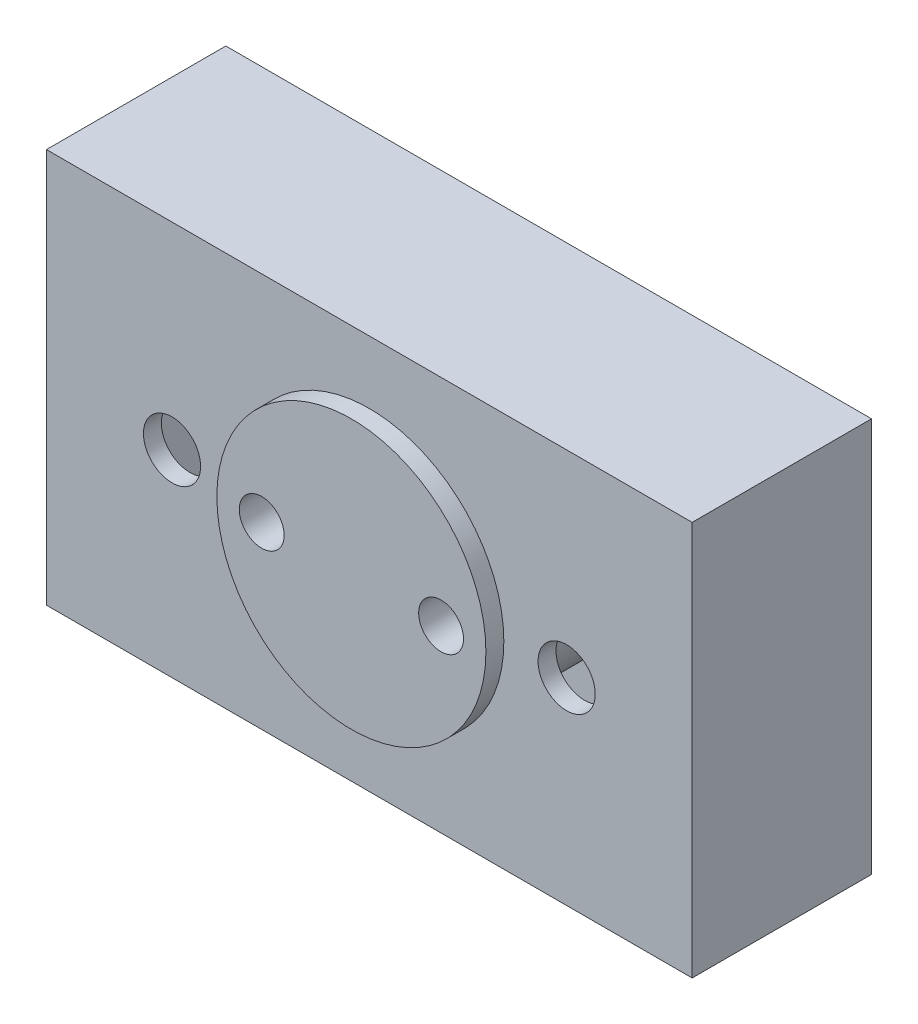
ISO-10303-21;
HEADER;
FILE_DESCRIPTION(('STEP AP214'),'2;1');
FILE_NAME('part.step','',(''),(''),'','','');
FILE_SCHEMA(('AUTOMOTIVE_DESIGN { 1 0 10303 214 1 1 1 1 }'));
ENDSEC;
DATA;
#1=APPLICATION_CONTEXT('core data for automotive mechanical design processes');
#2=APPLICATION_PROTOCOL_DEFINITION('international standard','automotive_design',2000,#1);
#3=PRODUCT_CONTEXT('',#1,'mechanical');
#4=PRODUCT('Part','Part','',(#3));
#5=PRODUCT_RELATED_PRODUCT_CATEGORY('part','',(#4));
#6=PRODUCT_DEFINITION_FORMATION('','',#4);
#7=PRODUCT_DEFINITION_CONTEXT('part definition',#1,'design');
#8=PRODUCT_DEFINITION('design','',#6,#7);
#9=PRODUCT_DEFINITION_SHAPE('','',#8);
#10=(LENGTH_UNIT() NAMED_UNIT(*) SI_UNIT(.MILLI.,.METRE.));
#11=(NAMED_UNIT(*) PLANE_ANGLE_UNIT() SI_UNIT($,.RADIAN.));
#12=(NAMED_UNIT(*) SI_UNIT($,.STERADIAN.) SOLID_ANGLE_UNIT());
#13=UNCERTAINTY_MEASURE_WITH_UNIT(LENGTH_MEASURE(1.E-05),#10,'distance_accuracy_value','');
#14=(GEOMETRIC_REPRESENTATION_CONTEXT(3) GLOBAL_UNCERTAINTY_ASSIGNED_CONTEXT((#13)) GLOBAL_UNIT_ASSIGNED_CONTEXT((#10,
#11,#12)) REPRESENTATION_CONTEXT('',''));
#15=CARTESIAN_POINT('',(0.,0.,0.));
#16=DIRECTION('',(0.,0.,1.));
#17=DIRECTION('',(1.,0.,0.));
#18=AXIS2_PLACEMENT_3D('',#15,#16,#17);
#19=CARTESIAN_POINT('',(-114.3,-69.85,57.15));
#20=DIRECTION('',(0.,0.,1.));
#21=DIRECTION('',(1.,0.,0.));
#22=AXIS2_PLACEMENT_3D('',#19,#20,#21);
#23=PLANE('',#22);
#24=CARTESIAN_POINT('',(69.85,0.,57.15));
#25=DIRECTION('',(0.,0.,1.));
#26=DIRECTION('',(1.,0.,0.));
#27=AXIS2_PLACEMENT_3D('',#24,#25,#26);
#28=CIRCLE('',#27,10.1203125);
#29=CARTESIAN_POINT('',(79.9703125,0.,57.15));
#30=VERTEX_POINT('',#29);
#31=EDGE_CURVE('E445',#30,#30,#28,.T.);
#32=ORIENTED_EDGE('',*,*,#31,.F.);
#33=EDGE_LOOP('',(#32));
#34=FACE_BOUND('',#33,.T.);
#35=DIRECTION('',(0.,-1.,0.));
#36=VECTOR('',#35,1.);
#37=CARTESIAN_POINT('',(-114.3,69.85,57.15));
#38=LINE('',#37,#36);
#39=CARTESIAN_POINT('',(-114.3,69.85,57.15));
#40=VERTEX_POINT('',#39);
#41=CARTESIAN_POINT('',(-114.3,-69.85,57.15));
#42=VERTEX_POINT('',#41);
#43=EDGE_CURVE('E421',#40,#42,#38,.T.);
#44=ORIENTED_EDGE('',*,*,#43,.T.);
#45=DIRECTION('',(1.,0.,0.));
#46=VECTOR('',#45,1.);
#47=CARTESIAN_POINT('',(-114.3,-69.85,57.15));
#48=LINE('',#47,#46);
#49=CARTESIAN_POINT('',(114.3,-69.85,57.15));
#50=VERTEX_POINT('',#49);
#51=EDGE_CURVE('E430',#42,#50,#48,.T.);
#52=ORIENTED_EDGE('',*,*,#51,.T.);
#53=DIRECTION('',(0.,1.,0.));
#54=VECTOR('',#53,1.);
#55=CARTESIAN_POINT('',(114.3,69.85,57.15));
#56=LINE('',#55,#54);
#57=CARTESIAN_POINT('',(114.3,69.85,57.15));
#58=VERTEX_POINT('',#57);
#59=EDGE_CURVE('E436',#50,#58,#56,.T.);
#60=ORIENTED_EDGE('',*,*,#59,.T.);
#61=DIRECTION('',(-1.,0.,0.));
#62=VECTOR('',#61,1.);
#63=CARTESIAN_POINT('',(-114.3,69.85,57.15));
#64=LINE('',#63,#62);
#65=EDGE_CURVE('E441',#58,#40,#64,.T.);
#66=ORIENTED_EDGE('',*,*,#65,.T.);
#67=EDGE_LOOP('',(#44,#52,#60,#66));
#68=FACE_BOUND('',#67,.T.);
#69=CARTESIAN_POINT('',(0.,0.,57.15));
#70=DIRECTION('',(0.,0.,1.));
#71=DIRECTION('',(1.,0.,0.));
#72=AXIS2_PLACEMENT_3D('',#69,#70,#71);
#73=CIRCLE('',#72,47.625);
#74=CARTESIAN_POINT('',(47.625,0.,57.15));
#75=VERTEX_POINT('',#74);
#76=EDGE_CURVE('E450',#75,#75,#73,.T.);
#77=ORIENTED_EDGE('',*,*,#76,.F.);
#78=EDGE_LOOP('',(#77));
#79=FACE_BOUND('',#78,.T.);
#80=CARTESIAN_POINT('',(-69.85,0.,57.15));
#81=DIRECTION('',(0.,0.,1.));
#82=DIRECTION('',(1.,0.,0.));
#83=AXIS2_PLACEMENT_3D('',#80,#81,#82);
#84=CIRCLE('',#83,10.1203125);
#85=CARTESIAN_POINT('',(-59.7296875,0.,57.15));
#86=VERTEX_POINT('',#85);
#87=EDGE_CURVE('E594',#86,#86,#84,.T.);
#88=ORIENTED_EDGE('',*,*,#87,.F.);
#89=EDGE_LOOP('',(#88));
#90=FACE_BOUND('',#89,.T.);
#91=ADVANCED_FACE('F352',(#34,#68,#79,#90),#23,.T.);
#92=CARTESIAN_POINT('',(-114.3,-69.85,50.8));
#93=DIRECTION('',(0.,0.,1.));
#94=DIRECTION('',(1.,0.,0.));
#95=AXIS2_PLACEMENT_3D('',#92,#93,#94);
#96=PLANE('',#95);
#97=CARTESIAN_POINT('',(69.85,0.,50.8));
#98=DIRECTION('',(0.,0.,1.));
#99=DIRECTION('',(1.,0.,0.));
#100=AXIS2_PLACEMENT_3D('',#97,#98,#99);
#101=CIRCLE('',#100,10.1203125);
#102=CARTESIAN_POINT('',(79.9703125,0.,50.8));
#103=VERTEX_POINT('',#102);
#104=EDGE_CURVE('E442',#103,#103,#101,.F.);
#105=ORIENTED_EDGE('',*,*,#104,.F.);
#106=EDGE_LOOP('',(#105));
#107=FACE_BOUND('',#106,.T.);
#108=DIRECTION('',(0.,-1.,0.));
#109=VECTOR('',#108,1.);
#110=CARTESIAN_POINT('',(-107.95,-208.524002802,50.8));
#111=LINE('',#110,#109);
#112=CARTESIAN_POINT('',(-107.95,63.5,50.8));
#113=VERTEX_POINT('',#112);
#114=CARTESIAN_POINT('',(-107.95,-63.5,50.8));
#115=VERTEX_POINT('',#114);
#116=EDGE_CURVE('E479',#113,#115,#111,.T.);
#117=ORIENTED_EDGE('',*,*,#116,.F.);
#118=DIRECTION('',(1.,0.,0.));
#119=VECTOR('',#118,1.);
#120=CARTESIAN_POINT('',(0.,63.5,50.8));
#121=LINE('',#120,#119);
#122=CARTESIAN_POINT('',(107.95,63.5,50.8));
#123=VERTEX_POINT('',#122);
#124=EDGE_CURVE('E482',#113,#123,#121,.T.);
#125=ORIENTED_EDGE('',*,*,#124,.T.);
#126=DIRECTION('',(0.,-1.,0.));
#127=VECTOR('',#126,1.);
#128=CARTESIAN_POINT('',(107.95,-208.524002802,50.8));
#129=LINE('',#128,#127);
#130=CARTESIAN_POINT('',(107.95,-63.5,50.8));
#131=VERTEX_POINT('',#130);
#132=EDGE_CURVE('E484',#123,#131,#129,.T.);
#133=ORIENTED_EDGE('',*,*,#132,.T.);
#134=DIRECTION('',(1.,0.,0.));
#135=VECTOR('',#134,1.);
#136=CARTESIAN_POINT('',(0.,-63.5,50.8));
#137=LINE('',#136,#135);
#138=EDGE_CURVE('E486',#115,#131,#137,.T.);
#139=ORIENTED_EDGE('',*,*,#138,.F.);
#140=EDGE_LOOP('',(#117,#125,#133,#139));
#141=FACE_BOUND('',#140,.T.);
#142=CARTESIAN_POINT('',(0.,0.,50.8));
#143=DIRECTION('',(0.,0.,1.));
#144=DIRECTION('',(1.,0.,0.));
#145=AXIS2_PLACEMENT_3D('',#142,#143,#144);
#146=CIRCLE('',#145,47.625);
#147=CARTESIAN_POINT('',(47.625,0.,50.8));
#148=VERTEX_POINT('',#147);
#149=EDGE_CURVE('E11',#148,#148,#146,.T.);
#150=ORIENTED_EDGE('',*,*,#149,.T.);
#151=EDGE_LOOP('',(#150));
#152=FACE_BOUND('',#151,.T.);
#153=CARTESIAN_POINT('',(-69.85,0.,50.8));
#154=DIRECTION('',(0.,0.,1.));
#155=DIRECTION('',(1.,0.,0.));
#156=AXIS2_PLACEMENT_3D('',#153,#154,#155);
#157=CIRCLE('',#156,10.1203125);
#158=CARTESIAN_POINT('',(-59.7296875,0.,50.8));
#159=VERTEX_POINT('',#158);
#160=EDGE_CURVE('E592',#159,#159,#157,.F.);
#161=ORIENTED_EDGE('',*,*,#160,.F.);
#162=EDGE_LOOP('',(#161));
#163=FACE_BOUND('',#162,.T.);
#164=ADVANCED_FACE('F539',(#107,#141,#152,#163),#96,.F.);
#165=CARTESIAN_POINT('',(114.3,69.85,0.));
#166=DIRECTION('',(0.,0.,-1.));
#167=DIRECTION('',(-1.,0.,0.));
#168=AXIS2_PLACEMENT_3D('',#165,#166,#167);
#169=PLANE('',#168);
#170=CARTESIAN_POINT('',(31.75,0.,0.));
#171=DIRECTION('',(0.,0.,1.));
#172=DIRECTION('',(1.,0.,0.));
#173=AXIS2_PLACEMENT_3D('',#170,#171,#172);
#174=CIRCLE('',#173,7.9375);
#175=CARTESIAN_POINT('',(39.6875,0.,0.));
#176=VERTEX_POINT('',#175);
#177=EDGE_CURVE('E457',#176,#176,#174,.T.);
#178=ORIENTED_EDGE('',*,*,#177,.T.);
#179=EDGE_LOOP('',(#178));
#180=FACE_BOUND('',#179,.T.);
#181=ADVANCED_FACE('F521',(#180),#169,.F.);
#182=CARTESIAN_POINT('',(-31.75,0.,0.));
#183=DIRECTION('',(0.,0.,1.));
#184=DIRECTION('',(1.,0.,0.));
#185=AXIS2_PLACEMENT_3D('',#182,#183,#184);
#186=CIRCLE('',#185,7.9375);
#187=CARTESIAN_POINT('',(-23.8125,0.,0.));
#188=VERTEX_POINT('',#187);
#189=EDGE_CURVE('E454',#188,#188,#186,.T.);
#190=ORIENTED_EDGE('',*,*,#189,.T.);
#191=EDGE_LOOP('',(#190));
#192=FACE_BOUND('',#191,.T.);
#193=ADVANCED_FACE('F520',(#192),#169,.F.);
#194=CARTESIAN_POINT('',(-114.3,69.85,-6.35));
#195=DIRECTION('',(0.,-1.,0.));
#196=DIRECTION('',(0.,0.,-1.));
#197=AXIS2_PLACEMENT_3D('',#194,#195,#196);
#198=PLANE('',#197);
#199=DIRECTION('',(0.,0.,1.));
#200=VECTOR('',#199,1.);
#201=CARTESIAN_POINT('',(-114.3,69.85,-6.35));
#202=LINE('',#201,#200);
#203=CARTESIAN_POINT('',(-114.3,69.85,-6.35));
#204=VERTEX_POINT('',#203);
#205=EDGE_CURVE('E376',#204,#40,#202,.T.);
#206=ORIENTED_EDGE('',*,*,#205,.T.);
#207=ORIENTED_EDGE('',*,*,#65,.F.);
#208=DIRECTION('',(0.,0.,1.));
#209=VECTOR('',#208,1.);
#210=CARTESIAN_POINT('',(114.3,69.85,-6.35));
#211=LINE('',#210,#209);
#212=CARTESIAN_POINT('',(114.3,69.85,-6.35));
#213=VERTEX_POINT('',#212);
#214=EDGE_CURVE('E506',#213,#58,#211,.T.);
#215=ORIENTED_EDGE('',*,*,#214,.F.);
#216=DIRECTION('',(1.,0.,0.));
#217=VECTOR('',#216,1.);
#218=CARTESIAN_POINT('',(-114.3,69.85,-6.35));
#219=LINE('',#218,#217);
#220=EDGE_CURVE('E497',#204,#213,#219,.T.);
#221=ORIENTED_EDGE('',*,*,#220,.F.);
#222=EDGE_LOOP('',(#206,#207,#215,#221));
#223=FACE_BOUND('',#222,.T.);
#224=ADVANCED_FACE('F354',(#223),#198,.F.);
#225=CARTESIAN_POINT('',(114.3,69.85,-6.35));
#226=DIRECTION('',(-1.,0.,0.));
#227=DIRECTION('',(0.,0.,1.));
#228=AXIS2_PLACEMENT_3D('',#225,#226,#227);
#229=PLANE('',#228);
#230=ORIENTED_EDGE('',*,*,#214,.T.);
#231=ORIENTED_EDGE('',*,*,#59,.F.);
#232=DIRECTION('',(0.,0.,1.));
#233=VECTOR('',#232,1.);
#234=CARTESIAN_POINT('',(114.3,-69.85,-6.35));
#235=LINE('',#234,#233);
#236=CARTESIAN_POINT('',(114.3,-69.85,-6.35));
#237=VERTEX_POINT('',#236);
#238=EDGE_CURVE('E427',#237,#50,#235,.T.);
#239=ORIENTED_EDGE('',*,*,#238,.F.);
#240=DIRECTION('',(0.,-1.,0.));
#241=VECTOR('',#240,1.);
#242=CARTESIAN_POINT('',(114.3,69.85,-6.35));
#243=LINE('',#242,#241);
#244=EDGE_CURVE('E500',#213,#237,#243,.T.);
#245=ORIENTED_EDGE('',*,*,#244,.F.);
#246=EDGE_LOOP('',(#230,#231,#239,#245));
#247=FACE_BOUND('',#246,.T.);
#248=ADVANCED_FACE('F645',(#247),#229,.F.);
#249=CARTESIAN_POINT('',(-114.3,-69.85,-6.35));
#250=DIRECTION('',(0.,-1.,0.));
#251=DIRECTION('',(1.,0.,0.));
#252=AXIS2_PLACEMENT_3D('',#249,#250,#251);
#253=PLANE('',#252);
#254=ORIENTED_EDGE('',*,*,#238,.T.);
#255=ORIENTED_EDGE('',*,*,#51,.F.);
#256=DIRECTION('',(0.,0.,1.));
#257=VECTOR('',#256,1.);
#258=CARTESIAN_POINT('',(-114.3,-69.85,-6.35));
#259=LINE('',#258,#257);
#260=CARTESIAN_POINT('',(-114.3,-69.85,-6.35));
#261=VERTEX_POINT('',#260);
#262=EDGE_CURVE('E417',#261,#42,#259,.T.);
#263=ORIENTED_EDGE('',*,*,#262,.F.);
#264=DIRECTION('',(1.,0.,0.));
#265=VECTOR('',#264,1.);
#266=CARTESIAN_POINT('',(-114.3,-69.85,-6.35));
#267=LINE('',#266,#265);
#268=EDGE_CURVE('E502',#261,#237,#267,.T.);
#269=ORIENTED_EDGE('',*,*,#268,.T.);
#270=EDGE_LOOP('',(#254,#255,#263,#269));
#271=FACE_BOUND('',#270,.T.);
#272=ADVANCED_FACE('F431',(#271),#253,.T.);
#273=CARTESIAN_POINT('',(-114.3,69.85,-6.35));
#274=DIRECTION('',(-1.,0.,0.));
#275=DIRECTION('',(0.,0.,1.));
#276=AXIS2_PLACEMENT_3D('',#273,#274,#275);
#277=PLANE('',#276);
#278=ORIENTED_EDGE('',*,*,#262,.T.);
#279=ORIENTED_EDGE('',*,*,#43,.F.);
#280=ORIENTED_EDGE('',*,*,#205,.F.);
#281=DIRECTION('',(0.,-1.,0.));
#282=VECTOR('',#281,1.);
#283=CARTESIAN_POINT('',(-114.3,69.85,-6.35));
#284=LINE('',#283,#282);
#285=EDGE_CURVE('E423',#204,#261,#284,.T.);
#286=ORIENTED_EDGE('',*,*,#285,.T.);
#287=EDGE_LOOP('',(#278,#279,#280,#286));
#288=FACE_BOUND('',#287,.T.);
#289=ADVANCED_FACE('F419',(#288),#277,.T.);
#290=CARTESIAN_POINT('',(114.3,69.85,-6.35));
#291=DIRECTION('',(0.,0.,-1.));
#292=DIRECTION('',(-1.,0.,0.));
#293=AXIS2_PLACEMENT_3D('',#290,#291,#292);
#294=PLANE('',#293);
#295=ORIENTED_EDGE('',*,*,#220,.T.);
#296=ORIENTED_EDGE('',*,*,#244,.T.);
#297=ORIENTED_EDGE('',*,*,#268,.F.);
#298=ORIENTED_EDGE('',*,*,#285,.F.);
#299=EDGE_LOOP('',(#295,#296,#297,#298));
#300=FACE_BOUND('',#299,.T.);
#301=ADVANCED_FACE('F563',(#300),#294,.T.);
#302=CARTESIAN_POINT('',(0.,0.,63.5));
#303=DIRECTION('',(0.,0.,-1.));
#304=DIRECTION('',(-1.,0.,0.));
#305=AXIS2_PLACEMENT_3D('',#302,#303,#304);
#306=CYLINDRICAL_SURFACE('',#305,47.625);
#307=ORIENTED_EDGE('',*,*,#76,.T.);
#308=EDGE_LOOP('',(#307));
#309=FACE_BOUND('',#308,.T.);
#310=CARTESIAN_POINT('',(0.,0.,63.5));
#311=DIRECTION('',(0.,0.,1.));
#312=DIRECTION('',(1.,0.,0.));
#313=AXIS2_PLACEMENT_3D('',#310,#311,#312);
#314=CIRCLE('',#313,47.625);
#315=CARTESIAN_POINT('',(47.625,0.,63.5));
#316=VERTEX_POINT('',#315);
#317=EDGE_CURVE('E463',#316,#316,#314,.T.);
#318=ORIENTED_EDGE('',*,*,#317,.F.);
#319=EDGE_LOOP('',(#318));
#320=FACE_BOUND('',#319,.T.);
#321=ADVANCED_FACE('F529',(#309,#320),#306,.T.);
#322=CARTESIAN_POINT('',(-31.75,0.,63.5));
#323=DIRECTION('',(0.,0.,-1.));
#324=DIRECTION('',(-1.,0.,0.));
#325=AXIS2_PLACEMENT_3D('',#322,#323,#324);
#326=CYLINDRICAL_SURFACE('',#325,7.9375);
#327=CARTESIAN_POINT('',(-31.75,0.,63.5));
#328=DIRECTION('',(0.,0.,1.));
#329=DIRECTION('',(1.,0.,0.));
#330=AXIS2_PLACEMENT_3D('',#327,#328,#329);
#331=CIRCLE('',#330,7.9375);
#332=CARTESIAN_POINT('',(-23.8125,0.,63.5));
#333=VERTEX_POINT('',#332);
#334=EDGE_CURVE('E460',#333,#333,#331,.T.);
#335=ORIENTED_EDGE('',*,*,#334,.T.);
#336=EDGE_LOOP('',(#335));
#337=FACE_BOUND('',#336,.T.);
#338=ORIENTED_EDGE('',*,*,#189,.F.);
#339=EDGE_LOOP('',(#338));
#340=FACE_BOUND('',#339,.T.);
#341=ADVANCED_FACE('F556',(#337,#340),#326,.F.);
#342=CARTESIAN_POINT('',(0.,-208.524002802,63.5));
#343=DIRECTION('',(0.,0.,1.));
#344=DIRECTION('',(1.,0.,0.));
#345=AXIS2_PLACEMENT_3D('',#342,#343,#344);
#346=PLANE('',#345);
#347=ORIENTED_EDGE('',*,*,#334,.F.);
#348=EDGE_LOOP('',(#347));
#349=FACE_BOUND('',#348,.T.);
#350=ORIENTED_EDGE('',*,*,#317,.T.);
#351=EDGE_LOOP('',(#350));
#352=FACE_BOUND('',#351,.T.);
#353=CARTESIAN_POINT('',(31.75,0.,63.5));
#354=DIRECTION('',(0.,0.,1.));
#355=DIRECTION('',(1.,0.,0.));
#356=AXIS2_PLACEMENT_3D('',#353,#354,#355);
#357=CIRCLE('',#356,7.9375);
#358=CARTESIAN_POINT('',(39.6875,0.,63.5));
#359=VERTEX_POINT('',#358);
#360=EDGE_CURVE('E466',#359,#359,#357,.T.);
#361=ORIENTED_EDGE('',*,*,#360,.F.);
#362=EDGE_LOOP('',(#361));
#363=FACE_BOUND('',#362,.T.);
#364=ADVANCED_FACE('F552',(#349,#352,#363),#346,.T.);
#365=CARTESIAN_POINT('',(31.75,0.,63.5));
#366=DIRECTION('',(0.,0.,-1.));
#367=DIRECTION('',(-1.,0.,0.));
#368=AXIS2_PLACEMENT_3D('',#365,#366,#367);
#369=CYLINDRICAL_SURFACE('',#368,7.9375);
#370=ORIENTED_EDGE('',*,*,#360,.T.);
#371=EDGE_LOOP('',(#370));
#372=FACE_BOUND('',#371,.T.);
#373=ORIENTED_EDGE('',*,*,#177,.F.);
#374=EDGE_LOOP('',(#373));
#375=FACE_BOUND('',#374,.T.);
#376=ADVANCED_FACE('F555',(#372,#375),#369,.F.);
#377=CARTESIAN_POINT('',(69.85,0.,57.15));
#378=DIRECTION('',(0.,0.,-1.));
#379=DIRECTION('',(-1.,0.,0.));
#380=AXIS2_PLACEMENT_3D('',#377,#378,#379);
#381=CYLINDRICAL_SURFACE('',#380,10.1203125);
#382=ORIENTED_EDGE('',*,*,#31,.T.);
#383=EDGE_LOOP('',(#382));
#384=FACE_BOUND('',#383,.T.);
#385=ORIENTED_EDGE('',*,*,#104,.T.);
#386=EDGE_LOOP('',(#385));
#387=FACE_BOUND('',#386,.T.);
#388=ADVANCED_FACE('F559',(#384,#387),#381,.F.);
#389=CARTESIAN_POINT('',(0.,-63.5,50.8));
#390=DIRECTION('',(0.,1.,0.));
#391=DIRECTION('',(0.,0.,1.));
#392=AXIS2_PLACEMENT_3D('',#389,#390,#391);
#393=PLANE('',#392);
#394=DIRECTION('',(1.,0.,0.));
#395=VECTOR('',#394,1.);
#396=CARTESIAN_POINT('',(0.,-63.5,0.));
#397=LINE('',#396,#395);
#398=CARTESIAN_POINT('',(-107.95,-63.5,0.));
#399=VERTEX_POINT('',#398);
#400=CARTESIAN_POINT('',(107.95,-63.5,0.));
#401=VERTEX_POINT('',#400);
#402=EDGE_CURVE('E476',#399,#401,#397,.T.);
#403=ORIENTED_EDGE('',*,*,#402,.F.);
#404=DIRECTION('',(0.,0.,-1.));
#405=VECTOR('',#404,1.);
#406=CARTESIAN_POINT('',(-107.95,-63.5,50.8));
#407=LINE('',#406,#405);
#408=EDGE_CURVE('E489',#115,#399,#407,.T.);
#409=ORIENTED_EDGE('',*,*,#408,.F.);
#410=ORIENTED_EDGE('',*,*,#138,.T.);
#411=DIRECTION('',(0.,0.,-1.));
#412=VECTOR('',#411,1.);
#413=CARTESIAN_POINT('',(107.95,-63.5,50.8));
#414=LINE('',#413,#412);
#415=EDGE_CURVE('E491',#131,#401,#414,.T.);
#416=ORIENTED_EDGE('',*,*,#415,.T.);
#417=EDGE_LOOP('',(#403,#409,#410,#416));
#418=FACE_BOUND('',#417,.T.);
#419=ADVANCED_FACE('F568',(#418),#393,.T.);
#420=CARTESIAN_POINT('',(107.95,-208.524002802,50.8));
#421=DIRECTION('',(1.,0.,0.));
#422=DIRECTION('',(0.,0.,-1.));
#423=AXIS2_PLACEMENT_3D('',#420,#421,#422);
#424=PLANE('',#423);
#425=DIRECTION('',(0.,-1.,0.));
#426=VECTOR('',#425,1.);
#427=CARTESIAN_POINT('',(107.95,-208.524002802,0.));
#428=LINE('',#427,#426);
#429=CARTESIAN_POINT('',(107.95,63.5,0.));
#430=VERTEX_POINT('',#429);
#431=EDGE_CURVE('E368',#430,#401,#428,.T.);
#432=ORIENTED_EDGE('',*,*,#431,.T.);
#433=ORIENTED_EDGE('',*,*,#415,.F.);
#434=ORIENTED_EDGE('',*,*,#132,.F.);
#435=DIRECTION('',(0.,0.,-1.));
#436=VECTOR('',#435,1.);
#437=CARTESIAN_POINT('',(107.95,63.5,50.8));
#438=LINE('',#437,#436);
#439=EDGE_CURVE('E493',#123,#430,#438,.T.);
#440=ORIENTED_EDGE('',*,*,#439,.T.);
#441=EDGE_LOOP('',(#432,#433,#434,#440));
#442=FACE_BOUND('',#441,.T.);
#443=ADVANCED_FACE('F571',(#442),#424,.F.);
#444=CARTESIAN_POINT('',(0.,63.5,50.8));
#445=DIRECTION('',(0.,1.,0.));
#446=DIRECTION('',(0.,0.,1.));
#447=AXIS2_PLACEMENT_3D('',#444,#445,#446);
#448=PLANE('',#447);
#449=DIRECTION('',(1.,0.,0.));
#450=VECTOR('',#449,1.);
#451=CARTESIAN_POINT('',(0.,63.5,0.));
#452=LINE('',#451,#450);
#453=CARTESIAN_POINT('',(-107.95,63.5,0.));
#454=VERTEX_POINT('',#453);
#455=EDGE_CURVE('E472',#454,#430,#452,.T.);
#456=ORIENTED_EDGE('',*,*,#455,.T.);
#457=ORIENTED_EDGE('',*,*,#439,.F.);
#458=ORIENTED_EDGE('',*,*,#124,.F.);
#459=DIRECTION('',(0.,0.,-1.));
#460=VECTOR('',#459,1.);
#461=CARTESIAN_POINT('',(-107.95,63.5,50.8));
#462=LINE('',#461,#460);
#463=EDGE_CURVE('E495',#113,#454,#462,.T.);
#464=ORIENTED_EDGE('',*,*,#463,.T.);
#465=EDGE_LOOP('',(#456,#457,#458,#464));
#466=FACE_BOUND('',#465,.T.);
#467=ADVANCED_FACE('F531',(#466),#448,.F.);
#468=CARTESIAN_POINT('',(-107.95,-208.524002802,50.8));
#469=DIRECTION('',(1.,0.,0.));
#470=DIRECTION('',(0.,0.,-1.));
#471=AXIS2_PLACEMENT_3D('',#468,#469,#470);
#472=PLANE('',#471);
#473=DIRECTION('',(0.,-1.,0.));
#474=VECTOR('',#473,1.);
#475=CARTESIAN_POINT('',(-107.95,-208.524002802,0.));
#476=LINE('',#475,#474);
#477=EDGE_CURVE('E469',#454,#399,#476,.T.);
#478=ORIENTED_EDGE('',*,*,#477,.F.);
#479=ORIENTED_EDGE('',*,*,#463,.F.);
#480=ORIENTED_EDGE('',*,*,#116,.T.);
#481=ORIENTED_EDGE('',*,*,#408,.T.);
#482=EDGE_LOOP('',(#478,#479,#480,#481));
#483=FACE_BOUND('',#482,.T.);
#484=ADVANCED_FACE('F517',(#483),#472,.T.);
#485=ORIENTED_EDGE('',*,*,#455,.F.);
#486=ORIENTED_EDGE('',*,*,#477,.T.);
#487=ORIENTED_EDGE('',*,*,#402,.T.);
#488=ORIENTED_EDGE('',*,*,#431,.F.);
#489=EDGE_LOOP('',(#485,#486,#487,#488));
#490=FACE_BOUND('',#489,.T.);
#491=CARTESIAN_POINT('',(0.,0.,0.));
#492=DIRECTION('',(0.,0.,-1.));
#493=DIRECTION('',(-1.,0.,0.));
#494=AXIS2_PLACEMENT_3D('',#491,#492,#493);
#495=CIRCLE('',#494,47.625);
#496=CARTESIAN_POINT('',(-47.625,0.,0.));
#497=VERTEX_POINT('',#496);
#498=EDGE_CURVE('E356',#497,#497,#495,.F.);
#499=ORIENTED_EDGE('',*,*,#498,.F.);
#500=EDGE_LOOP('',(#499));
#501=FACE_BOUND('',#500,.T.);
#502=ADVANCED_FACE('F515',(#490,#501),#169,.F.);
#503=ORIENTED_EDGE('',*,*,#498,.T.);
#504=EDGE_LOOP('',(#503));
#505=FACE_BOUND('',#504,.T.);
#506=ORIENTED_EDGE('',*,*,#149,.F.);
#507=EDGE_LOOP('',(#506));
#508=FACE_BOUND('',#507,.T.);
#509=ADVANCED_FACE('F512',(#505,#508),#306,.T.);
#510=CARTESIAN_POINT('',(-69.85,0.,57.15));
#511=DIRECTION('',(0.,0.,-1.));
#512=DIRECTION('',(-1.,0.,0.));
#513=AXIS2_PLACEMENT_3D('',#510,#511,#512);
#514=CYLINDRICAL_SURFACE('',#513,10.1203125);
#515=ORIENTED_EDGE('',*,*,#87,.T.);
#516=EDGE_LOOP('',(#515));
#517=FACE_BOUND('',#516,.T.);
#518=ORIENTED_EDGE('',*,*,#160,.T.);
#519=EDGE_LOOP('',(#518));
#520=FACE_BOUND('',#519,.T.);
#521=ADVANCED_FACE('F527',(#517,#520),#514,.F.);
#522=CLOSED_SHELL('',(#91,#164,#181,#193,#224,#248,#272,#289,#301,#321,#341,#364,#376,#388,#419,
#443,#467,#484,#502,#509,#521));
#523=MANIFOLD_SOLID_BREP('B2',#522);
#524=ADVANCED_BREP_SHAPE_REPRESENTATION('',(#18,#523),#14);
#525=SHAPE_DEFINITION_REPRESENTATION(#9,#524);
ENDSEC;
END-ISO-10303-21;
